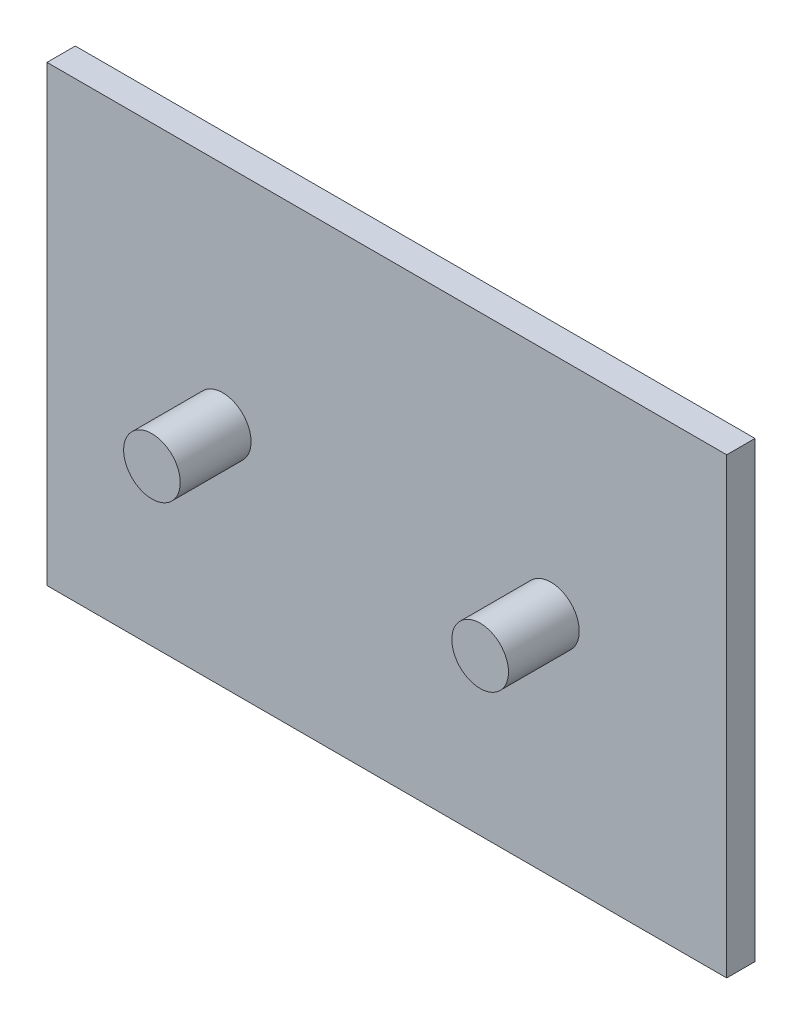
ISO-10303-21;
HEADER;
FILE_DESCRIPTION(('STEP AP214'),'2;1');
FILE_NAME('part.step','',(''),(''),'','','');
FILE_SCHEMA(('AUTOMOTIVE_DESIGN { 1 0 10303 214 1 1 1 1 }'));
ENDSEC;
DATA;
#1=APPLICATION_CONTEXT('core data for automotive mechanical design processes');
#2=APPLICATION_PROTOCOL_DEFINITION('international standard','automotive_design',2000,#1);
#3=PRODUCT_CONTEXT('',#1,'mechanical');
#4=PRODUCT('Part','Part','',(#3));
#5=PRODUCT_RELATED_PRODUCT_CATEGORY('part','',(#4));
#6=PRODUCT_DEFINITION_FORMATION('','',#4);
#7=PRODUCT_DEFINITION_CONTEXT('part definition',#1,'design');
#8=PRODUCT_DEFINITION('design','',#6,#7);
#9=PRODUCT_DEFINITION_SHAPE('','',#8);
#10=(LENGTH_UNIT() NAMED_UNIT(*) SI_UNIT(.MILLI.,.METRE.));
#11=(NAMED_UNIT(*) PLANE_ANGLE_UNIT() SI_UNIT($,.RADIAN.));
#12=(NAMED_UNIT(*) SI_UNIT($,.STERADIAN.) SOLID_ANGLE_UNIT());
#13=UNCERTAINTY_MEASURE_WITH_UNIT(LENGTH_MEASURE(1.E-05),#10,'distance_accuracy_value','');
#14=(GEOMETRIC_REPRESENTATION_CONTEXT(3) GLOBAL_UNCERTAINTY_ASSIGNED_CONTEXT((#13)) GLOBAL_UNIT_ASSIGNED_CONTEXT((#10,
#11,#12)) REPRESENTATION_CONTEXT('',''));
#15=CARTESIAN_POINT('',(0.,0.,0.));
#16=DIRECTION('',(0.,0.,1.));
#17=DIRECTION('',(1.,0.,0.));
#18=AXIS2_PLACEMENT_3D('',#15,#16,#17);
#19=CARTESIAN_POINT('',(152.4,-101.6,6.35));
#20=DIRECTION('',(-1.,0.,0.));
#21=DIRECTION('',(0.,0.,1.));
#22=AXIS2_PLACEMENT_3D('',#19,#20,#21);
#23=PLANE('',#22);
#24=DIRECTION('',(0.,1.,0.));
#25=VECTOR('',#24,1.);
#26=CARTESIAN_POINT('',(152.4,-101.6,-6.35));
#27=LINE('',#26,#25);
#28=CARTESIAN_POINT('',(152.4,-101.6,-6.35));
#29=VERTEX_POINT('',#28);
#30=CARTESIAN_POINT('',(152.4,101.6,-6.35));
#31=VERTEX_POINT('',#30);
#32=EDGE_CURVE('E111',#29,#31,#27,.T.);
#33=ORIENTED_EDGE('',*,*,#32,.T.);
#34=DIRECTION('',(0.,0.,-1.));
#35=VECTOR('',#34,1.);
#36=CARTESIAN_POINT('',(152.4,101.6,6.35));
#37=LINE('',#36,#35);
#38=CARTESIAN_POINT('',(152.4,101.6,6.35));
#39=VERTEX_POINT('',#38);
#40=EDGE_CURVE('E100',#39,#31,#37,.T.);
#41=ORIENTED_EDGE('',*,*,#40,.F.);
#42=DIRECTION('',(0.,1.,0.));
#43=VECTOR('',#42,1.);
#44=CARTESIAN_POINT('',(152.4,-101.6,6.35));
#45=LINE('',#44,#43);
#46=CARTESIAN_POINT('',(152.4,-101.6,6.35));
#47=VERTEX_POINT('',#46);
#48=EDGE_CURVE('E92',#47,#39,#45,.T.);
#49=ORIENTED_EDGE('',*,*,#48,.F.);
#50=DIRECTION('',(0.,0.,-1.));
#51=VECTOR('',#50,1.);
#52=CARTESIAN_POINT('',(152.4,-101.6,6.35));
#53=LINE('',#52,#51);
#54=EDGE_CURVE('E107',#47,#29,#53,.T.);
#55=ORIENTED_EDGE('',*,*,#54,.T.);
#56=EDGE_LOOP('',(#33,#41,#49,#55));
#57=FACE_BOUND('',#56,.T.);
#58=ADVANCED_FACE('F39',(#57),#23,.F.);
#59=CARTESIAN_POINT('',(-152.4,101.6,6.35));
#60=DIRECTION('',(0.,-1.,0.));
#61=DIRECTION('',(0.,0.,-1.));
#62=AXIS2_PLACEMENT_3D('',#59,#60,#61);
#63=PLANE('',#62);
#64=DIRECTION('',(-1.,0.,0.));
#65=VECTOR('',#64,1.);
#66=CARTESIAN_POINT('',(-152.4,101.6,-6.35));
#67=LINE('',#66,#65);
#68=CARTESIAN_POINT('',(-152.4,101.6,-6.35));
#69=VERTEX_POINT('',#68);
#70=EDGE_CURVE('E98',#31,#69,#67,.T.);
#71=ORIENTED_EDGE('',*,*,#70,.T.);
#72=DIRECTION('',(0.,0.,-1.));
#73=VECTOR('',#72,1.);
#74=CARTESIAN_POINT('',(-152.4,101.6,6.35));
#75=LINE('',#74,#73);
#76=CARTESIAN_POINT('',(-152.4,101.6,6.35));
#77=VERTEX_POINT('',#76);
#78=EDGE_CURVE('E96',#77,#69,#75,.T.);
#79=ORIENTED_EDGE('',*,*,#78,.F.);
#80=DIRECTION('',(-1.,0.,0.));
#81=VECTOR('',#80,1.);
#82=CARTESIAN_POINT('',(-152.4,101.6,6.35));
#83=LINE('',#82,#81);
#84=EDGE_CURVE('E87',#39,#77,#83,.T.);
#85=ORIENTED_EDGE('',*,*,#84,.F.);
#86=ORIENTED_EDGE('',*,*,#40,.T.);
#87=EDGE_LOOP('',(#71,#79,#85,#86));
#88=FACE_BOUND('',#87,.T.);
#89=ADVANCED_FACE('F97',(#88),#63,.F.);
#90=CARTESIAN_POINT('',(-152.4,-101.6,6.35));
#91=DIRECTION('',(1.,0.,0.));
#92=DIRECTION('',(0.,0.,-1.));
#93=AXIS2_PLACEMENT_3D('',#90,#91,#92);
#94=PLANE('',#93);
#95=DIRECTION('',(0.,-1.,0.));
#96=VECTOR('',#95,1.);
#97=CARTESIAN_POINT('',(-152.4,-101.6,-6.35));
#98=LINE('',#97,#96);
#99=CARTESIAN_POINT('',(-152.4,-101.6,-6.35));
#100=VERTEX_POINT('',#99);
#101=EDGE_CURVE('E73',#69,#100,#98,.T.);
#102=ORIENTED_EDGE('',*,*,#101,.T.);
#103=DIRECTION('',(0.,0.,-1.));
#104=VECTOR('',#103,1.);
#105=CARTESIAN_POINT('',(-152.4,-101.6,6.35));
#106=LINE('',#105,#104);
#107=CARTESIAN_POINT('',(-152.4,-101.6,6.35));
#108=VERTEX_POINT('',#107);
#109=EDGE_CURVE('E101',#108,#100,#106,.T.);
#110=ORIENTED_EDGE('',*,*,#109,.F.);
#111=DIRECTION('',(0.,-1.,0.));
#112=VECTOR('',#111,1.);
#113=CARTESIAN_POINT('',(-152.4,-101.6,6.35));
#114=LINE('',#113,#112);
#115=EDGE_CURVE('E90',#77,#108,#114,.T.);
#116=ORIENTED_EDGE('',*,*,#115,.F.);
#117=ORIENTED_EDGE('',*,*,#78,.T.);
#118=EDGE_LOOP('',(#102,#110,#116,#117));
#119=FACE_BOUND('',#118,.T.);
#120=ADVANCED_FACE('F103',(#119),#94,.F.);
#121=CARTESIAN_POINT('',(-152.4,-101.6,6.35));
#122=DIRECTION('',(0.,1.,0.));
#123=DIRECTION('',(0.,0.,1.));
#124=AXIS2_PLACEMENT_3D('',#121,#122,#123);
#125=PLANE('',#124);
#126=DIRECTION('',(1.,0.,0.));
#127=VECTOR('',#126,1.);
#128=CARTESIAN_POINT('',(-152.4,-101.6,-6.35));
#129=LINE('',#128,#127);
#130=EDGE_CURVE('E79',#100,#29,#129,.T.);
#131=ORIENTED_EDGE('',*,*,#130,.T.);
#132=ORIENTED_EDGE('',*,*,#54,.F.);
#133=DIRECTION('',(1.,0.,0.));
#134=VECTOR('',#133,1.);
#135=CARTESIAN_POINT('',(-152.4,-101.6,6.35));
#136=LINE('',#135,#134);
#137=EDGE_CURVE('E56',#108,#47,#136,.T.);
#138=ORIENTED_EDGE('',*,*,#137,.F.);
#139=ORIENTED_EDGE('',*,*,#109,.T.);
#140=EDGE_LOOP('',(#131,#132,#138,#139));
#141=FACE_BOUND('',#140,.T.);
#142=ADVANCED_FACE('F135',(#141),#125,.F.);
#143=CARTESIAN_POINT('',(0.,0.,6.35));
#144=DIRECTION('',(0.,0.,-1.));
#145=DIRECTION('',(-1.,0.,0.));
#146=AXIS2_PLACEMENT_3D('',#143,#144,#145);
#147=PLANE('',#146);
#148=CARTESIAN_POINT('',(-73.588104792,0.,6.35));
#149=DIRECTION('',(0.,0.,-1.));
#150=DIRECTION('',(-1.,0.,0.));
#151=AXIS2_PLACEMENT_3D('',#148,#149,#150);
#152=CIRCLE('',#151,12.7);
#153=CARTESIAN_POINT('',(-86.288104792,0.,6.35));
#154=VERTEX_POINT('',#153);
#155=EDGE_CURVE('E11',#154,#154,#152,.F.);
#156=ORIENTED_EDGE('',*,*,#155,.F.);
#157=EDGE_LOOP('',(#156));
#158=FACE_BOUND('',#157,.T.);
#159=CARTESIAN_POINT('',(73.588104792,0.,6.35));
#160=DIRECTION('',(0.,0.,-1.));
#161=DIRECTION('',(-1.,0.,0.));
#162=AXIS2_PLACEMENT_3D('',#159,#160,#161);
#163=CIRCLE('',#162,12.7);
#164=CARTESIAN_POINT('',(60.888104792,0.,6.35));
#165=VERTEX_POINT('',#164);
#166=EDGE_CURVE('E48',#165,#165,#163,.F.);
#167=ORIENTED_EDGE('',*,*,#166,.F.);
#168=EDGE_LOOP('',(#167));
#169=FACE_BOUND('',#168,.T.);
#170=ORIENTED_EDGE('',*,*,#48,.T.);
#171=ORIENTED_EDGE('',*,*,#84,.T.);
#172=ORIENTED_EDGE('',*,*,#115,.T.);
#173=ORIENTED_EDGE('',*,*,#137,.T.);
#174=EDGE_LOOP('',(#170,#171,#172,#173));
#175=FACE_BOUND('',#174,.T.);
#176=ADVANCED_FACE('F88',(#158,#169,#175),#147,.F.);
#177=CARTESIAN_POINT('',(0.,0.,-6.35));
#178=DIRECTION('',(0.,0.,-1.));
#179=DIRECTION('',(-1.,0.,0.));
#180=AXIS2_PLACEMENT_3D('',#177,#178,#179);
#181=PLANE('',#180);
#182=ORIENTED_EDGE('',*,*,#32,.F.);
#183=ORIENTED_EDGE('',*,*,#130,.F.);
#184=ORIENTED_EDGE('',*,*,#101,.F.);
#185=ORIENTED_EDGE('',*,*,#70,.F.);
#186=EDGE_LOOP('',(#182,#183,#184,#185));
#187=FACE_BOUND('',#186,.T.);
#188=ADVANCED_FACE('F134',(#187),#181,.T.);
#189=CARTESIAN_POINT('',(73.588104792,0.,38.1));
#190=DIRECTION('',(0.,0.,-1.));
#191=DIRECTION('',(-1.,0.,0.));
#192=AXIS2_PLACEMENT_3D('',#189,#190,#191);
#193=CYLINDRICAL_SURFACE('',#192,12.7);
#194=CARTESIAN_POINT('',(73.588104792,0.,38.1));
#195=DIRECTION('',(0.,0.,1.));
#196=DIRECTION('',(1.,0.,0.));
#197=AXIS2_PLACEMENT_3D('',#194,#195,#196);
#198=CIRCLE('',#197,12.7);
#199=CARTESIAN_POINT('',(86.288104792,0.,38.1));
#200=VERTEX_POINT('',#199);
#201=EDGE_CURVE('E115',#200,#200,#198,.T.);
#202=ORIENTED_EDGE('',*,*,#201,.F.);
#203=EDGE_LOOP('',(#202));
#204=FACE_BOUND('',#203,.T.);
#205=ORIENTED_EDGE('',*,*,#166,.T.);
#206=EDGE_LOOP('',(#205));
#207=FACE_BOUND('',#206,.T.);
#208=ADVANCED_FACE('F131',(#204,#207),#193,.T.);
#209=CARTESIAN_POINT('',(73.588104792,0.,38.1));
#210=DIRECTION('',(0.,0.,1.));
#211=DIRECTION('',(1.,0.,0.));
#212=AXIS2_PLACEMENT_3D('',#209,#210,#211);
#213=PLANE('',#212);
#214=ORIENTED_EDGE('',*,*,#201,.T.);
#215=EDGE_LOOP('',(#214));
#216=FACE_BOUND('',#215,.T.);
#217=ADVANCED_FACE('F168',(#216),#213,.T.);
#218=CARTESIAN_POINT('',(-73.588104792,0.,38.1));
#219=DIRECTION('',(0.,0.,-1.));
#220=DIRECTION('',(-1.,0.,0.));
#221=AXIS2_PLACEMENT_3D('',#218,#219,#220);
#222=CYLINDRICAL_SURFACE('',#221,12.7);
#223=CARTESIAN_POINT('',(-73.588104792,0.,38.1));
#224=DIRECTION('',(0.,0.,1.));
#225=DIRECTION('',(1.,0.,0.));
#226=AXIS2_PLACEMENT_3D('',#223,#224,#225);
#227=CIRCLE('',#226,12.7);
#228=CARTESIAN_POINT('',(-60.888104792,0.,38.1));
#229=VERTEX_POINT('',#228);
#230=EDGE_CURVE('E158',#229,#229,#227,.T.);
#231=ORIENTED_EDGE('',*,*,#230,.F.);
#232=EDGE_LOOP('',(#231));
#233=FACE_BOUND('',#232,.T.);
#234=ORIENTED_EDGE('',*,*,#155,.T.);
#235=EDGE_LOOP('',(#234));
#236=FACE_BOUND('',#235,.T.);
#237=ADVANCED_FACE('F165',(#233,#236),#222,.T.);
#238=CARTESIAN_POINT('',(-73.588104792,0.,38.1));
#239=DIRECTION('',(0.,0.,1.));
#240=DIRECTION('',(1.,0.,0.));
#241=AXIS2_PLACEMENT_3D('',#238,#239,#240);
#242=PLANE('',#241);
#243=ORIENTED_EDGE('',*,*,#230,.T.);
#244=EDGE_LOOP('',(#243));
#245=FACE_BOUND('',#244,.T.);
#246=ADVANCED_FACE('F163',(#245),#242,.T.);
#247=CLOSED_SHELL('',(#58,#89,#120,#142,#176,#188,#208,#217,#237,#246));
#248=MANIFOLD_SOLID_BREP('B2',#247);
#249=ADVANCED_BREP_SHAPE_REPRESENTATION('',(#18,#248),#14);
#250=SHAPE_DEFINITION_REPRESENTATION(#9,#249);
ENDSEC;
END-ISO-10303-21;
